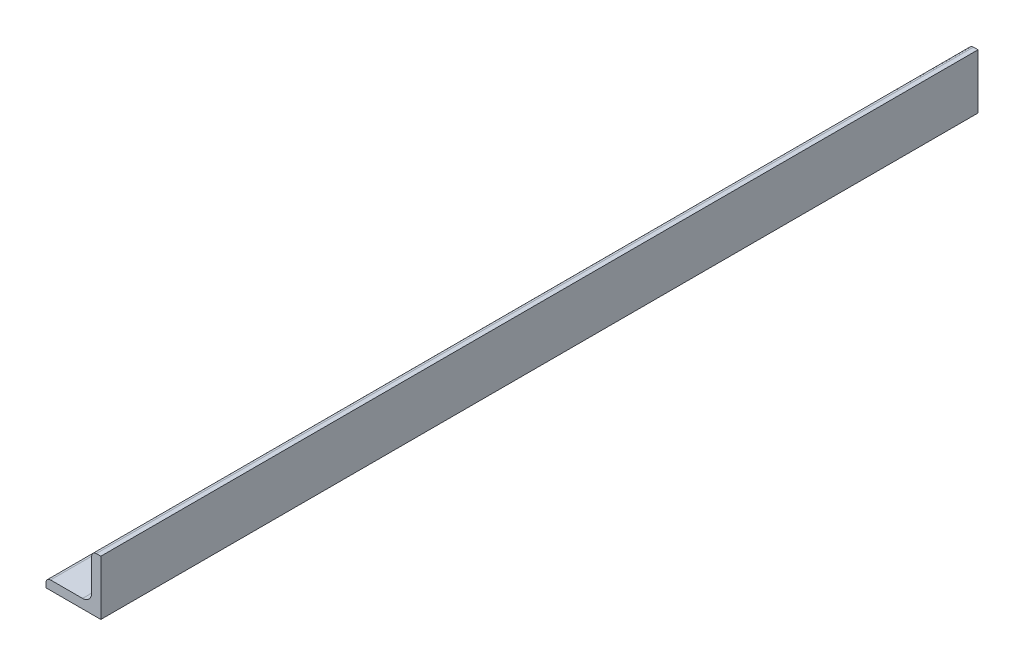
ISO-10303-21;
HEADER;
FILE_DESCRIPTION(('STEP AP214'),'2;1');
FILE_NAME('part.step','',(''),(''),'','','');
FILE_SCHEMA(('AUTOMOTIVE_DESIGN { 1 0 10303 214 1 1 1 1 }'));
ENDSEC;
DATA;
#1=APPLICATION_CONTEXT('core data for automotive mechanical design processes');
#2=APPLICATION_PROTOCOL_DEFINITION('international standard','automotive_design',2000,#1);
#3=PRODUCT_CONTEXT('',#1,'mechanical');
#4=PRODUCT('Part','Part','',(#3));
#5=PRODUCT_RELATED_PRODUCT_CATEGORY('part','',(#4));
#6=PRODUCT_DEFINITION_FORMATION('','',#4);
#7=PRODUCT_DEFINITION_CONTEXT('part definition',#1,'design');
#8=PRODUCT_DEFINITION('design','',#6,#7);
#9=PRODUCT_DEFINITION_SHAPE('','',#8);
#10=(LENGTH_UNIT() NAMED_UNIT(*) SI_UNIT(.MILLI.,.METRE.));
#11=(NAMED_UNIT(*) PLANE_ANGLE_UNIT() SI_UNIT($,.RADIAN.));
#12=(NAMED_UNIT(*) SI_UNIT($,.STERADIAN.) SOLID_ANGLE_UNIT());
#13=UNCERTAINTY_MEASURE_WITH_UNIT(LENGTH_MEASURE(1.E-05),#10,'distance_accuracy_value','');
#14=(GEOMETRIC_REPRESENTATION_CONTEXT(3) GLOBAL_UNCERTAINTY_ASSIGNED_CONTEXT((#13)) GLOBAL_UNIT_ASSIGNED_CONTEXT((#10,
#11,#12)) REPRESENTATION_CONTEXT('',''));
#15=CARTESIAN_POINT('',(0.,0.,0.));
#16=DIRECTION('',(0.,0.,1.));
#17=DIRECTION('',(1.,0.,0.));
#18=AXIS2_PLACEMENT_3D('',#15,#16,#17);
#19=CARTESIAN_POINT('',(-9.525,-7.9375,152.4));
#20=DIRECTION('',(1.,0.,0.));
#21=DIRECTION('',(0.,0.,-1.));
#22=AXIS2_PLACEMENT_3D('',#19,#20,#21);
#23=PLANE('',#22);
#24=DIRECTION('',(0.,-1.,0.));
#25=VECTOR('',#24,1.);
#26=CARTESIAN_POINT('',(-9.525,-7.9375,-152.4));
#27=LINE('',#26,#25);
#28=CARTESIAN_POINT('',(-9.525,-7.9375,-152.4));
#29=VERTEX_POINT('',#28);
#30=CARTESIAN_POINT('',(-9.525,-9.525,-152.4));
#31=VERTEX_POINT('',#30);
#32=EDGE_CURVE('E141',#29,#31,#27,.T.);
#33=ORIENTED_EDGE('',*,*,#32,.T.);
#34=DIRECTION('',(0.,0.,-1.));
#35=VECTOR('',#34,1.);
#36=CARTESIAN_POINT('',(-9.525,-9.525,152.4));
#37=LINE('',#36,#35);
#38=CARTESIAN_POINT('',(-9.525,-9.525,152.4));
#39=VERTEX_POINT('',#38);
#40=EDGE_CURVE('E11',#39,#31,#37,.T.);
#41=ORIENTED_EDGE('',*,*,#40,.F.);
#42=DIRECTION('',(0.,-1.,0.));
#43=VECTOR('',#42,1.);
#44=CARTESIAN_POINT('',(-9.525,-7.9375,152.4));
#45=LINE('',#44,#43);
#46=CARTESIAN_POINT('',(-9.525,-7.9375,152.4));
#47=VERTEX_POINT('',#46);
#48=EDGE_CURVE('E157',#47,#39,#45,.T.);
#49=ORIENTED_EDGE('',*,*,#48,.F.);
#50=DIRECTION('',(0.,0.,-1.));
#51=VECTOR('',#50,1.);
#52=CARTESIAN_POINT('',(-9.525,-7.9375,152.4));
#53=LINE('',#52,#51);
#54=EDGE_CURVE('E137',#47,#29,#53,.T.);
#55=ORIENTED_EDGE('',*,*,#54,.T.);
#56=EDGE_LOOP('',(#33,#41,#49,#55));
#57=FACE_BOUND('',#56,.T.);
#58=ADVANCED_FACE('F39',(#57),#23,.F.);
#59=CARTESIAN_POINT('',(-9.525,-9.525,152.4));
#60=DIRECTION('',(0.,1.,0.));
#61=DIRECTION('',(-1.,0.,0.));
#62=AXIS2_PLACEMENT_3D('',#59,#60,#61);
#63=PLANE('',#62);
#64=DIRECTION('',(1.,0.,0.));
#65=VECTOR('',#64,1.);
#66=CARTESIAN_POINT('',(-9.525,-9.525,-152.4));
#67=LINE('',#66,#65);
#68=CARTESIAN_POINT('',(9.525,-9.525,-152.4));
#69=VERTEX_POINT('',#68);
#70=EDGE_CURVE('E144',#31,#69,#67,.T.);
#71=ORIENTED_EDGE('',*,*,#70,.T.);
#72=DIRECTION('',(0.,0.,-1.));
#73=VECTOR('',#72,1.);
#74=CARTESIAN_POINT('',(9.525,-9.525,152.4));
#75=LINE('',#74,#73);
#76=CARTESIAN_POINT('',(9.525,-9.525,152.4));
#77=VERTEX_POINT('',#76);
#78=EDGE_CURVE('E47',#77,#69,#75,.T.);
#79=ORIENTED_EDGE('',*,*,#78,.F.);
#80=DIRECTION('',(1.,0.,0.));
#81=VECTOR('',#80,1.);
#82=CARTESIAN_POINT('',(-9.525,-9.525,152.4));
#83=LINE('',#82,#81);
#84=EDGE_CURVE('E101',#39,#77,#83,.T.);
#85=ORIENTED_EDGE('',*,*,#84,.F.);
#86=ORIENTED_EDGE('',*,*,#40,.T.);
#87=EDGE_LOOP('',(#71,#79,#85,#86));
#88=FACE_BOUND('',#87,.T.);
#89=ADVANCED_FACE('F200',(#88),#63,.F.);
#90=CARTESIAN_POINT('',(9.525,-9.525,152.4));
#91=DIRECTION('',(-1.,0.,0.));
#92=DIRECTION('',(0.,-1.,0.));
#93=AXIS2_PLACEMENT_3D('',#90,#91,#92);
#94=PLANE('',#93);
#95=DIRECTION('',(0.,1.,0.));
#96=VECTOR('',#95,1.);
#97=CARTESIAN_POINT('',(9.525,-9.525,-152.4));
#98=LINE('',#97,#96);
#99=CARTESIAN_POINT('',(9.525,9.525,-152.4));
#100=VERTEX_POINT('',#99);
#101=EDGE_CURVE('E146',#69,#100,#98,.T.);
#102=ORIENTED_EDGE('',*,*,#101,.T.);
#103=DIRECTION('',(0.,0.,-1.));
#104=VECTOR('',#103,1.);
#105=CARTESIAN_POINT('',(9.525,9.525,152.4));
#106=LINE('',#105,#104);
#107=CARTESIAN_POINT('',(9.525,9.525,152.4));
#108=VERTEX_POINT('',#107);
#109=EDGE_CURVE('E167',#108,#100,#106,.T.);
#110=ORIENTED_EDGE('',*,*,#109,.F.);
#111=DIRECTION('',(0.,1.,0.));
#112=VECTOR('',#111,1.);
#113=CARTESIAN_POINT('',(9.525,-9.525,152.4));
#114=LINE('',#113,#112);
#115=EDGE_CURVE('E175',#77,#108,#114,.T.);
#116=ORIENTED_EDGE('',*,*,#115,.F.);
#117=ORIENTED_EDGE('',*,*,#78,.T.);
#118=EDGE_LOOP('',(#102,#110,#116,#117));
#119=FACE_BOUND('',#118,.T.);
#120=ADVANCED_FACE('F173',(#119),#94,.F.);
#121=CARTESIAN_POINT('',(7.9375,9.525,152.4));
#122=DIRECTION('',(0.,-1.,0.));
#123=DIRECTION('',(1.,0.,0.));
#124=AXIS2_PLACEMENT_3D('',#121,#122,#123);
#125=PLANE('',#124);
#126=DIRECTION('',(-1.,0.,0.));
#127=VECTOR('',#126,1.);
#128=CARTESIAN_POINT('',(7.9375,9.525,-152.4));
#129=LINE('',#128,#127);
#130=CARTESIAN_POINT('',(7.9375,9.525,-152.4));
#131=VERTEX_POINT('',#130);
#132=EDGE_CURVE('E148',#100,#131,#129,.T.);
#133=ORIENTED_EDGE('',*,*,#132,.T.);
#134=DIRECTION('',(0.,0.,-1.));
#135=VECTOR('',#134,1.);
#136=CARTESIAN_POINT('',(7.9375,9.525,152.4));
#137=LINE('',#136,#135);
#138=CARTESIAN_POINT('',(7.9375,9.525,152.4));
#139=VERTEX_POINT('',#138);
#140=EDGE_CURVE('E164',#139,#131,#137,.T.);
#141=ORIENTED_EDGE('',*,*,#140,.F.);
#142=DIRECTION('',(-1.,0.,0.));
#143=VECTOR('',#142,1.);
#144=CARTESIAN_POINT('',(7.9375,9.525,152.4));
#145=LINE('',#144,#143);
#146=EDGE_CURVE('E191',#108,#139,#145,.T.);
#147=ORIENTED_EDGE('',*,*,#146,.F.);
#148=ORIENTED_EDGE('',*,*,#109,.T.);
#149=EDGE_LOOP('',(#133,#141,#147,#148));
#150=FACE_BOUND('',#149,.T.);
#151=ADVANCED_FACE('F184',(#150),#125,.F.);
#152=CARTESIAN_POINT('',(7.9375,7.9375,152.4));
#153=DIRECTION('',(0.,0.,-1.));
#154=DIRECTION('',(-1.,0.,0.));
#155=AXIS2_PLACEMENT_3D('',#152,#153,#154);
#156=CYLINDRICAL_SURFACE('',#155,1.5875);
#157=CARTESIAN_POINT('',(7.9375,7.9375,-152.4));
#158=DIRECTION('',(0.,0.,1.));
#159=DIRECTION('',(-1.,0.,0.));
#160=AXIS2_PLACEMENT_3D('',#157,#158,#159);
#161=CIRCLE('',#160,1.5875);
#162=CARTESIAN_POINT('',(6.35,7.9375,-152.4));
#163=VERTEX_POINT('',#162);
#164=EDGE_CURVE('E150',#131,#163,#161,.T.);
#165=ORIENTED_EDGE('',*,*,#164,.T.);
#166=DIRECTION('',(0.,0.,-1.));
#167=VECTOR('',#166,1.);
#168=CARTESIAN_POINT('',(6.35,7.9375,152.4));
#169=LINE('',#168,#167);
#170=CARTESIAN_POINT('',(6.35,7.9375,152.4));
#171=VERTEX_POINT('',#170);
#172=EDGE_CURVE('E161',#171,#163,#169,.T.);
#173=ORIENTED_EDGE('',*,*,#172,.F.);
#174=CARTESIAN_POINT('',(7.9375,7.9375,152.4));
#175=DIRECTION('',(0.,0.,1.));
#176=DIRECTION('',(-1.,0.,0.));
#177=AXIS2_PLACEMENT_3D('',#174,#175,#176);
#178=CIRCLE('',#177,1.5875);
#179=EDGE_CURVE('E190',#139,#171,#178,.T.);
#180=ORIENTED_EDGE('',*,*,#179,.F.);
#181=ORIENTED_EDGE('',*,*,#140,.T.);
#182=EDGE_LOOP('',(#165,#173,#180,#181));
#183=FACE_BOUND('',#182,.T.);
#184=ADVANCED_FACE('F188',(#183),#156,.T.);
#185=CARTESIAN_POINT('',(6.35,7.9375,152.4));
#186=DIRECTION('',(1.,0.,0.));
#187=DIRECTION('',(0.,1.,0.));
#188=AXIS2_PLACEMENT_3D('',#185,#186,#187);
#189=PLANE('',#188);
#190=DIRECTION('',(0.,-1.,0.));
#191=VECTOR('',#190,1.);
#192=CARTESIAN_POINT('',(6.35,7.9375,-152.4));
#193=LINE('',#192,#191);
#194=CARTESIAN_POINT('',(6.35,-3.175,-152.4));
#195=VERTEX_POINT('',#194);
#196=EDGE_CURVE('E152',#163,#195,#193,.T.);
#197=ORIENTED_EDGE('',*,*,#196,.T.);
#198=DIRECTION('',(0.,0.,-1.));
#199=VECTOR('',#198,1.);
#200=CARTESIAN_POINT('',(6.35,-3.175,152.4));
#201=LINE('',#200,#199);
#202=CARTESIAN_POINT('',(6.35,-3.175,152.4));
#203=VERTEX_POINT('',#202);
#204=EDGE_CURVE('E132',#203,#195,#201,.T.);
#205=ORIENTED_EDGE('',*,*,#204,.F.);
#206=DIRECTION('',(0.,-1.,0.));
#207=VECTOR('',#206,1.);
#208=CARTESIAN_POINT('',(6.35,7.9375,152.4));
#209=LINE('',#208,#207);
#210=EDGE_CURVE('E123',#171,#203,#209,.T.);
#211=ORIENTED_EDGE('',*,*,#210,.F.);
#212=ORIENTED_EDGE('',*,*,#172,.T.);
#213=EDGE_LOOP('',(#197,#205,#211,#212));
#214=FACE_BOUND('',#213,.T.);
#215=ADVANCED_FACE('F212',(#214),#189,.F.);
#216=CARTESIAN_POINT('',(3.17500000000001,-3.175,152.4));
#217=DIRECTION('',(0.,0.,-1.));
#218=DIRECTION('',(-1.,0.,0.));
#219=AXIS2_PLACEMENT_3D('',#216,#217,#218);
#220=CYLINDRICAL_SURFACE('',#219,3.175);
#221=CARTESIAN_POINT('',(3.17500000000001,-3.175,-152.4));
#222=DIRECTION('',(0.,0.,-1.));
#223=DIRECTION('',(-1.,0.,0.));
#224=AXIS2_PLACEMENT_3D('',#221,#222,#223);
#225=CIRCLE('',#224,3.175);
#226=CARTESIAN_POINT('',(3.17500000000001,-6.35,-152.4));
#227=VERTEX_POINT('',#226);
#228=EDGE_CURVE('E131',#195,#227,#225,.T.);
#229=ORIENTED_EDGE('',*,*,#228,.T.);
#230=DIRECTION('',(0.,0.,-1.));
#231=VECTOR('',#230,1.);
#232=CARTESIAN_POINT('',(3.17500000000001,-6.35,152.4));
#233=LINE('',#232,#231);
#234=CARTESIAN_POINT('',(3.17500000000001,-6.35,152.4));
#235=VERTEX_POINT('',#234);
#236=EDGE_CURVE('E128',#235,#227,#233,.T.);
#237=ORIENTED_EDGE('',*,*,#236,.F.);
#238=CARTESIAN_POINT('',(3.17500000000001,-3.175,152.4));
#239=DIRECTION('',(0.,0.,-1.));
#240=DIRECTION('',(-1.,0.,0.));
#241=AXIS2_PLACEMENT_3D('',#238,#239,#240);
#242=CIRCLE('',#241,3.175);
#243=EDGE_CURVE('E117',#203,#235,#242,.T.);
#244=ORIENTED_EDGE('',*,*,#243,.F.);
#245=ORIENTED_EDGE('',*,*,#204,.T.);
#246=EDGE_LOOP('',(#229,#237,#244,#245));
#247=FACE_BOUND('',#246,.T.);
#248=ADVANCED_FACE('F129',(#247),#220,.F.);
#249=CARTESIAN_POINT('',(3.17500000000001,-6.35,152.4));
#250=DIRECTION('',(0.,-1.,0.));
#251=DIRECTION('',(1.,0.,0.));
#252=AXIS2_PLACEMENT_3D('',#249,#250,#251);
#253=PLANE('',#252);
#254=DIRECTION('',(-1.,0.,0.));
#255=VECTOR('',#254,1.);
#256=CARTESIAN_POINT('',(3.17500000000001,-6.35,-152.4));
#257=LINE('',#256,#255);
#258=CARTESIAN_POINT('',(-7.9375,-6.35,-152.4));
#259=VERTEX_POINT('',#258);
#260=EDGE_CURVE('E87',#227,#259,#257,.T.);
#261=ORIENTED_EDGE('',*,*,#260,.T.);
#262=DIRECTION('',(0.,0.,-1.));
#263=VECTOR('',#262,1.);
#264=CARTESIAN_POINT('',(-7.9375,-6.35,152.4));
#265=LINE('',#264,#263);
#266=CARTESIAN_POINT('',(-7.9375,-6.35,152.4));
#267=VERTEX_POINT('',#266);
#268=EDGE_CURVE('E133',#267,#259,#265,.T.);
#269=ORIENTED_EDGE('',*,*,#268,.F.);
#270=DIRECTION('',(-1.,0.,0.));
#271=VECTOR('',#270,1.);
#272=CARTESIAN_POINT('',(3.17500000000001,-6.35,152.4));
#273=LINE('',#272,#271);
#274=EDGE_CURVE('E121',#235,#267,#273,.T.);
#275=ORIENTED_EDGE('',*,*,#274,.F.);
#276=ORIENTED_EDGE('',*,*,#236,.T.);
#277=EDGE_LOOP('',(#261,#269,#275,#276));
#278=FACE_BOUND('',#277,.T.);
#279=ADVANCED_FACE('F135',(#278),#253,.F.);
#280=CARTESIAN_POINT('',(-7.9375,-7.9375,152.4));
#281=DIRECTION('',(0.,0.,-1.));
#282=DIRECTION('',(-1.,0.,0.));
#283=AXIS2_PLACEMENT_3D('',#280,#281,#282);
#284=CYLINDRICAL_SURFACE('',#283,1.5875);
#285=CARTESIAN_POINT('',(-7.9375,-7.9375,-152.4));
#286=DIRECTION('',(0.,0.,1.));
#287=DIRECTION('',(-1.,0.,0.));
#288=AXIS2_PLACEMENT_3D('',#285,#286,#287);
#289=CIRCLE('',#288,1.5875);
#290=EDGE_CURVE('E93',#259,#29,#289,.T.);
#291=ORIENTED_EDGE('',*,*,#290,.T.);
#292=ORIENTED_EDGE('',*,*,#54,.F.);
#293=CARTESIAN_POINT('',(-7.9375,-7.9375,152.4));
#294=DIRECTION('',(0.,0.,1.));
#295=DIRECTION('',(-1.,0.,0.));
#296=AXIS2_PLACEMENT_3D('',#293,#294,#295);
#297=CIRCLE('',#296,1.5875);
#298=EDGE_CURVE('E55',#267,#47,#297,.T.);
#299=ORIENTED_EDGE('',*,*,#298,.F.);
#300=ORIENTED_EDGE('',*,*,#268,.T.);
#301=EDGE_LOOP('',(#291,#292,#299,#300));
#302=FACE_BOUND('',#301,.T.);
#303=ADVANCED_FACE('F220',(#302),#284,.T.);
#304=CARTESIAN_POINT('',(7.9375,7.9375,152.4));
#305=DIRECTION('',(0.,0.,-1.));
#306=DIRECTION('',(-1.,0.,0.));
#307=AXIS2_PLACEMENT_3D('',#304,#305,#306);
#308=PLANE('',#307);
#309=ORIENTED_EDGE('',*,*,#48,.T.);
#310=ORIENTED_EDGE('',*,*,#84,.T.);
#311=ORIENTED_EDGE('',*,*,#115,.T.);
#312=ORIENTED_EDGE('',*,*,#146,.T.);
#313=ORIENTED_EDGE('',*,*,#179,.T.);
#314=ORIENTED_EDGE('',*,*,#210,.T.);
#315=ORIENTED_EDGE('',*,*,#243,.T.);
#316=ORIENTED_EDGE('',*,*,#274,.T.);
#317=ORIENTED_EDGE('',*,*,#298,.T.);
#318=EDGE_LOOP('',(#309,#310,#311,#312,#313,#314,#315,#316,#317));
#319=FACE_BOUND('',#318,.T.);
#320=ADVANCED_FACE('F119',(#319),#308,.F.);
#321=CARTESIAN_POINT('',(7.9375,7.9375,-152.4));
#322=DIRECTION('',(0.,0.,-1.));
#323=DIRECTION('',(-1.,0.,0.));
#324=AXIS2_PLACEMENT_3D('',#321,#322,#323);
#325=PLANE('',#324);
#326=ORIENTED_EDGE('',*,*,#32,.F.);
#327=ORIENTED_EDGE('',*,*,#290,.F.);
#328=ORIENTED_EDGE('',*,*,#260,.F.);
#329=ORIENTED_EDGE('',*,*,#228,.F.);
#330=ORIENTED_EDGE('',*,*,#196,.F.);
#331=ORIENTED_EDGE('',*,*,#164,.F.);
#332=ORIENTED_EDGE('',*,*,#132,.F.);
#333=ORIENTED_EDGE('',*,*,#101,.F.);
#334=ORIENTED_EDGE('',*,*,#70,.F.);
#335=EDGE_LOOP('',(#326,#327,#328,#329,#330,#331,#332,#333,#334));
#336=FACE_BOUND('',#335,.T.);
#337=ADVANCED_FACE('F179',(#336),#325,.T.);
#338=CLOSED_SHELL('',(#58,#89,#120,#151,#184,#215,#248,#279,#303,#320,#337));
#339=MANIFOLD_SOLID_BREP('B2',#338);
#340=ADVANCED_BREP_SHAPE_REPRESENTATION('',(#18,#339),#14);
#341=SHAPE_DEFINITION_REPRESENTATION(#9,#340);
ENDSEC;
END-ISO-10303-21;
